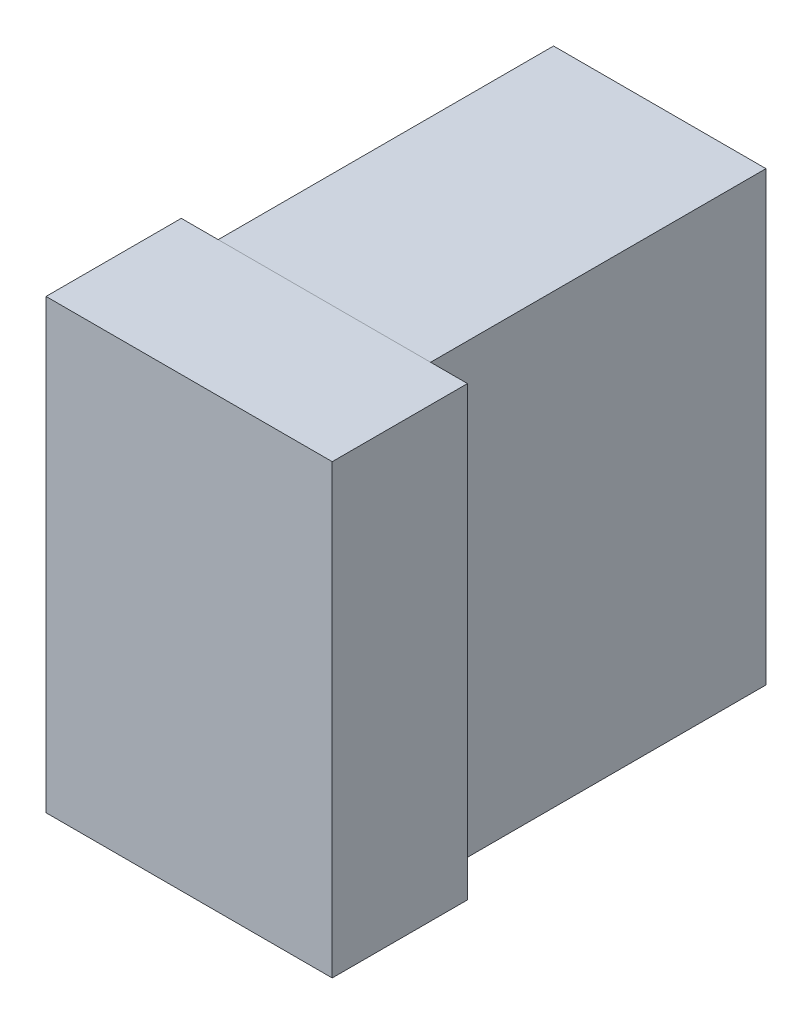
ISO-10303-21;
HEADER;
FILE_DESCRIPTION(('STEP AP214'),'2;1');
FILE_NAME('part.step','',(''),(''),'','','');
FILE_SCHEMA(('AUTOMOTIVE_DESIGN { 1 0 10303 214 1 1 1 1 }'));
ENDSEC;
DATA;
#1=APPLICATION_CONTEXT('core data for automotive mechanical design processes');
#2=APPLICATION_PROTOCOL_DEFINITION('international standard','automotive_design',2000,#1);
#3=PRODUCT_CONTEXT('',#1,'mechanical');
#4=PRODUCT('Part','Part','',(#3));
#5=PRODUCT_RELATED_PRODUCT_CATEGORY('part','',(#4));
#6=PRODUCT_DEFINITION_FORMATION('','',#4);
#7=PRODUCT_DEFINITION_CONTEXT('part definition',#1,'design');
#8=PRODUCT_DEFINITION('design','',#6,#7);
#9=PRODUCT_DEFINITION_SHAPE('','',#8);
#10=(LENGTH_UNIT() NAMED_UNIT(*) SI_UNIT(.MILLI.,.METRE.));
#11=(NAMED_UNIT(*) PLANE_ANGLE_UNIT() SI_UNIT($,.RADIAN.));
#12=(NAMED_UNIT(*) SI_UNIT($,.STERADIAN.) SOLID_ANGLE_UNIT());
#13=UNCERTAINTY_MEASURE_WITH_UNIT(LENGTH_MEASURE(1.E-05),#10,'distance_accuracy_value','');
#14=(GEOMETRIC_REPRESENTATION_CONTEXT(3) GLOBAL_UNCERTAINTY_ASSIGNED_CONTEXT((#13)) GLOBAL_UNIT_ASSIGNED_CONTEXT((#10,
#11,#12)) REPRESENTATION_CONTEXT('',''));
#15=CARTESIAN_POINT('',(0.,0.,0.));
#16=DIRECTION('',(0.,0.,1.));
#17=DIRECTION('',(1.,0.,0.));
#18=AXIS2_PLACEMENT_3D('',#15,#16,#17);
#19=CARTESIAN_POINT('',(0.,20.,0.));
#20=DIRECTION('',(0.,1.,0.));
#21=DIRECTION('',(0.,0.,1.));
#22=AXIS2_PLACEMENT_3D('',#19,#20,#21);
#23=PLANE('',#22);
#24=DIRECTION('',(0.,0.,1.));
#25=VECTOR('',#24,1.);
#26=CARTESIAN_POINT('',(4.75,20.,-21.05));
#27=LINE('',#26,#25);
#28=CARTESIAN_POINT('',(4.75,20.,-21.05));
#29=VERTEX_POINT('',#28);
#30=CARTESIAN_POINT('',(4.75,20.,-6.05));
#31=VERTEX_POINT('',#30);
#32=EDGE_CURVE('E56',#29,#31,#27,.T.);
#33=ORIENTED_EDGE('',*,*,#32,.F.);
#34=DIRECTION('',(1.,0.,0.));
#35=VECTOR('',#34,1.);
#36=CARTESIAN_POINT('',(-4.75,20.,-21.05));
#37=LINE('',#36,#35);
#38=CARTESIAN_POINT('',(-4.75,20.,-21.05));
#39=VERTEX_POINT('',#38);
#40=EDGE_CURVE('E79',#39,#29,#37,.T.);
#41=ORIENTED_EDGE('',*,*,#40,.F.);
#42=DIRECTION('',(0.,0.,-1.));
#43=VECTOR('',#42,1.);
#44=CARTESIAN_POINT('',(-4.75,20.,-6.05));
#45=LINE('',#44,#43);
#46=CARTESIAN_POINT('',(-4.75,20.,-6.05));
#47=VERTEX_POINT('',#46);
#48=EDGE_CURVE('E84',#47,#39,#45,.T.);
#49=ORIENTED_EDGE('',*,*,#48,.F.);
#50=DIRECTION('',(-1.,0.,0.));
#51=VECTOR('',#50,1.);
#52=CARTESIAN_POINT('',(4.75,20.,-6.05));
#53=LINE('',#52,#51);
#54=EDGE_CURVE('E99',#31,#47,#53,.T.);
#55=ORIENTED_EDGE('',*,*,#54,.F.);
#56=EDGE_LOOP('',(#33,#41,#49,#55));
#57=FACE_BOUND('',#56,.T.);
#58=ADVANCED_FACE('F48',(#57),#23,.T.);
#59=CARTESIAN_POINT('',(0.,0.,0.));
#60=DIRECTION('',(0.,-1.,0.));
#61=DIRECTION('',(0.,0.,-1.));
#62=AXIS2_PLACEMENT_3D('',#59,#60,#61);
#63=PLANE('',#62);
#64=DIRECTION('',(0.,0.,1.));
#65=VECTOR('',#64,1.);
#66=CARTESIAN_POINT('',(4.75,0.,-21.05));
#67=LINE('',#66,#65);
#68=CARTESIAN_POINT('',(4.75,0.,-21.05));
#69=VERTEX_POINT('',#68);
#70=CARTESIAN_POINT('',(4.75,0.,-6.05));
#71=VERTEX_POINT('',#70);
#72=EDGE_CURVE('E108',#69,#71,#67,.T.);
#73=ORIENTED_EDGE('',*,*,#72,.T.);
#74=DIRECTION('',(-1.,0.,0.));
#75=VECTOR('',#74,1.);
#76=CARTESIAN_POINT('',(4.75,0.,-6.05));
#77=LINE('',#76,#75);
#78=CARTESIAN_POINT('',(-4.75,0.,-6.05));
#79=VERTEX_POINT('',#78);
#80=EDGE_CURVE('E97',#71,#79,#77,.T.);
#81=ORIENTED_EDGE('',*,*,#80,.T.);
#82=DIRECTION('',(0.,0.,-1.));
#83=VECTOR('',#82,1.);
#84=CARTESIAN_POINT('',(-4.75,0.,-6.05));
#85=LINE('',#84,#83);
#86=CARTESIAN_POINT('',(-4.75,0.,-21.05));
#87=VERTEX_POINT('',#86);
#88=EDGE_CURVE('E100',#79,#87,#85,.T.);
#89=ORIENTED_EDGE('',*,*,#88,.T.);
#90=DIRECTION('',(1.,0.,0.));
#91=VECTOR('',#90,1.);
#92=CARTESIAN_POINT('',(-4.75,0.,-21.05));
#93=LINE('',#92,#91);
#94=EDGE_CURVE('E105',#87,#69,#93,.T.);
#95=ORIENTED_EDGE('',*,*,#94,.T.);
#96=EDGE_LOOP('',(#73,#81,#89,#95));
#97=FACE_BOUND('',#96,.T.);
#98=ADVANCED_FACE('F107',(#97),#63,.T.);
#99=CARTESIAN_POINT('',(4.75,37.7552809045647,-6.05));
#100=DIRECTION('',(0.,0.,1.));
#101=DIRECTION('',(1.,0.,0.));
#102=AXIS2_PLACEMENT_3D('',#99,#100,#101);
#103=PLANE('',#102);
#104=DIRECTION('',(0.,-1.,0.));
#105=VECTOR('',#104,1.);
#106=CARTESIAN_POINT('',(4.75,37.7552809045647,-6.05));
#107=LINE('',#106,#105);
#108=EDGE_CURVE('E12',#31,#71,#107,.T.);
#109=ORIENTED_EDGE('',*,*,#108,.F.);
#110=ORIENTED_EDGE('',*,*,#54,.T.);
#111=DIRECTION('',(0.,-1.,0.));
#112=VECTOR('',#111,1.);
#113=CARTESIAN_POINT('',(-4.75,37.7552809045647,-6.05));
#114=LINE('',#113,#112);
#115=EDGE_CURVE('E94',#47,#79,#114,.T.);
#116=ORIENTED_EDGE('',*,*,#115,.T.);
#117=ORIENTED_EDGE('',*,*,#80,.F.);
#118=EDGE_LOOP('',(#109,#110,#116,#117));
#119=FACE_BOUND('',#118,.T.);
#120=ADVANCED_FACE('F95',(#119),#103,.T.);
#121=CARTESIAN_POINT('',(-4.75,37.7552809045647,-6.05));
#122=DIRECTION('',(-1.,0.,0.));
#123=DIRECTION('',(0.,0.,1.));
#124=AXIS2_PLACEMENT_3D('',#121,#122,#123);
#125=PLANE('',#124);
#126=ORIENTED_EDGE('',*,*,#115,.F.);
#127=ORIENTED_EDGE('',*,*,#48,.T.);
#128=DIRECTION('',(0.,-1.,0.));
#129=VECTOR('',#128,1.);
#130=CARTESIAN_POINT('',(-4.75,37.7552809045647,-21.05));
#131=LINE('',#130,#129);
#132=EDGE_CURVE('E89',#39,#87,#131,.T.);
#133=ORIENTED_EDGE('',*,*,#132,.T.);
#134=ORIENTED_EDGE('',*,*,#88,.F.);
#135=EDGE_LOOP('',(#126,#127,#133,#134));
#136=FACE_BOUND('',#135,.T.);
#137=ADVANCED_FACE('F101',(#136),#125,.T.);
#138=CARTESIAN_POINT('',(-4.75,37.7552809045647,-21.05));
#139=DIRECTION('',(0.,0.,-1.));
#140=DIRECTION('',(-1.,0.,0.));
#141=AXIS2_PLACEMENT_3D('',#138,#139,#140);
#142=PLANE('',#141);
#143=ORIENTED_EDGE('',*,*,#132,.F.);
#144=ORIENTED_EDGE('',*,*,#40,.T.);
#145=DIRECTION('',(0.,-1.,0.));
#146=VECTOR('',#145,1.);
#147=CARTESIAN_POINT('',(4.75,37.7552809045647,-21.05));
#148=LINE('',#147,#146);
#149=EDGE_CURVE('E115',#29,#69,#148,.T.);
#150=ORIENTED_EDGE('',*,*,#149,.T.);
#151=ORIENTED_EDGE('',*,*,#94,.F.);
#152=EDGE_LOOP('',(#143,#144,#150,#151));
#153=FACE_BOUND('',#152,.T.);
#154=ADVANCED_FACE('F121',(#153),#142,.T.);
#155=CARTESIAN_POINT('',(4.75,37.7552809045647,-21.05));
#156=DIRECTION('',(1.,0.,0.));
#157=DIRECTION('',(0.,0.,-1.));
#158=AXIS2_PLACEMENT_3D('',#155,#156,#157);
#159=PLANE('',#158);
#160=ORIENTED_EDGE('',*,*,#149,.F.);
#161=ORIENTED_EDGE('',*,*,#32,.T.);
#162=ORIENTED_EDGE('',*,*,#108,.T.);
#163=ORIENTED_EDGE('',*,*,#72,.F.);
#164=EDGE_LOOP('',(#160,#161,#162,#163));
#165=FACE_BOUND('',#164,.T.);
#166=ADVANCED_FACE('F122',(#165),#159,.T.);
#167=CLOSED_SHELL('',(#58,#98,#120,#137,#154,#166));
#168=MANIFOLD_SOLID_BREP('B2',#167);
#169=CARTESIAN_POINT('',(-6.4,20.,0.));
#170=DIRECTION('',(0.,0.,-1.));
#171=DIRECTION('',(-1.,0.,0.));
#172=AXIS2_PLACEMENT_3D('',#169,#170,#171);
#173=PLANE('',#172);
#174=DIRECTION('',(1.,0.,0.));
#175=VECTOR('',#174,1.);
#176=CARTESIAN_POINT('',(-6.4,0.,0.));
#177=LINE('',#176,#175);
#178=CARTESIAN_POINT('',(-6.4,0.,0.));
#179=VERTEX_POINT('',#178);
#180=CARTESIAN_POINT('',(6.4,0.,0.));
#181=VERTEX_POINT('',#180);
#182=EDGE_CURVE('E234',#179,#181,#177,.T.);
#183=ORIENTED_EDGE('',*,*,#182,.T.);
#184=DIRECTION('',(0.,-1.,0.));
#185=VECTOR('',#184,1.);
#186=CARTESIAN_POINT('',(6.4,20.,0.));
#187=LINE('',#186,#185);
#188=CARTESIAN_POINT('',(6.4,20.,0.));
#189=VERTEX_POINT('',#188);
#190=EDGE_CURVE('E46',#189,#181,#187,.T.);
#191=ORIENTED_EDGE('',*,*,#190,.F.);
#192=DIRECTION('',(1.,0.,0.));
#193=VECTOR('',#192,1.);
#194=CARTESIAN_POINT('',(-6.4,20.,0.));
#195=LINE('',#194,#193);
#196=CARTESIAN_POINT('',(-6.4,20.,0.));
#197=VERTEX_POINT('',#196);
#198=EDGE_CURVE('E222',#197,#189,#195,.T.);
#199=ORIENTED_EDGE('',*,*,#198,.F.);
#200=DIRECTION('',(0.,-1.,0.));
#201=VECTOR('',#200,1.);
#202=CARTESIAN_POINT('',(-6.4,20.,0.));
#203=LINE('',#202,#201);
#204=EDGE_CURVE('E230',#197,#179,#203,.T.);
#205=ORIENTED_EDGE('',*,*,#204,.T.);
#206=EDGE_LOOP('',(#183,#191,#199,#205));
#207=FACE_BOUND('',#206,.T.);
#208=ADVANCED_FACE('F171',(#207),#173,.F.);
#209=CARTESIAN_POINT('',(6.4,20.,0.));
#210=DIRECTION('',(-1.,0.,0.));
#211=DIRECTION('',(0.,0.,1.));
#212=AXIS2_PLACEMENT_3D('',#209,#210,#211);
#213=PLANE('',#212);
#214=DIRECTION('',(0.,0.,-1.));
#215=VECTOR('',#214,1.);
#216=CARTESIAN_POINT('',(6.4,0.,0.));
#217=LINE('',#216,#215);
#218=CARTESIAN_POINT('',(6.4,0.,-6.05));
#219=VERTEX_POINT('',#218);
#220=EDGE_CURVE('E226',#181,#219,#217,.T.);
#221=ORIENTED_EDGE('',*,*,#220,.T.);
#222=DIRECTION('',(0.,-1.,0.));
#223=VECTOR('',#222,1.);
#224=CARTESIAN_POINT('',(6.4,20.,-6.05));
#225=LINE('',#224,#223);
#226=CARTESIAN_POINT('',(6.4,20.,-6.05));
#227=VERTEX_POINT('',#226);
#228=EDGE_CURVE('E179',#227,#219,#225,.T.);
#229=ORIENTED_EDGE('',*,*,#228,.F.);
#230=DIRECTION('',(0.,0.,-1.));
#231=VECTOR('',#230,1.);
#232=CARTESIAN_POINT('',(6.4,20.,0.));
#233=LINE('',#232,#231);
#234=EDGE_CURVE('E217',#189,#227,#233,.T.);
#235=ORIENTED_EDGE('',*,*,#234,.F.);
#236=ORIENTED_EDGE('',*,*,#190,.T.);
#237=EDGE_LOOP('',(#221,#229,#235,#236));
#238=FACE_BOUND('',#237,.T.);
#239=ADVANCED_FACE('F225',(#238),#213,.F.);
#240=CARTESIAN_POINT('',(6.4,20.,-6.05));
#241=DIRECTION('',(0.,0.,1.));
#242=DIRECTION('',(1.,0.,0.));
#243=AXIS2_PLACEMENT_3D('',#240,#241,#242);
#244=PLANE('',#243);
#245=DIRECTION('',(-1.,0.,0.));
#246=VECTOR('',#245,1.);
#247=CARTESIAN_POINT('',(6.4,0.,-6.05));
#248=LINE('',#247,#246);
#249=CARTESIAN_POINT('',(-6.4,0.,-6.05));
#250=VERTEX_POINT('',#249);
#251=EDGE_CURVE('E204',#219,#250,#248,.T.);
#252=ORIENTED_EDGE('',*,*,#251,.T.);
#253=DIRECTION('',(0.,-1.,0.));
#254=VECTOR('',#253,1.);
#255=CARTESIAN_POINT('',(-6.4,20.,-6.05));
#256=LINE('',#255,#254);
#257=CARTESIAN_POINT('',(-6.4,20.,-6.05));
#258=VERTEX_POINT('',#257);
#259=EDGE_CURVE('E227',#258,#250,#256,.T.);
#260=ORIENTED_EDGE('',*,*,#259,.F.);
#261=DIRECTION('',(-1.,0.,0.));
#262=VECTOR('',#261,1.);
#263=CARTESIAN_POINT('',(6.4,20.,-6.05));
#264=LINE('',#263,#262);
#265=EDGE_CURVE('E220',#227,#258,#264,.T.);
#266=ORIENTED_EDGE('',*,*,#265,.F.);
#267=ORIENTED_EDGE('',*,*,#228,.T.);
#268=EDGE_LOOP('',(#252,#260,#266,#267));
#269=FACE_BOUND('',#268,.T.);
#270=ADVANCED_FACE('F228',(#269),#244,.F.);
#271=CARTESIAN_POINT('',(-6.4,20.,-6.05));
#272=DIRECTION('',(1.,0.,0.));
#273=DIRECTION('',(0.,0.,-1.));
#274=AXIS2_PLACEMENT_3D('',#271,#272,#273);
#275=PLANE('',#274);
#276=DIRECTION('',(0.,0.,1.));
#277=VECTOR('',#276,1.);
#278=CARTESIAN_POINT('',(-6.4,0.,-6.05));
#279=LINE('',#278,#277);
#280=EDGE_CURVE('E210',#250,#179,#279,.T.);
#281=ORIENTED_EDGE('',*,*,#280,.T.);
#282=ORIENTED_EDGE('',*,*,#204,.F.);
#283=DIRECTION('',(0.,0.,1.));
#284=VECTOR('',#283,1.);
#285=CARTESIAN_POINT('',(-6.4,20.,-6.05));
#286=LINE('',#285,#284);
#287=EDGE_CURVE('E187',#258,#197,#286,.T.);
#288=ORIENTED_EDGE('',*,*,#287,.F.);
#289=ORIENTED_EDGE('',*,*,#259,.T.);
#290=EDGE_LOOP('',(#281,#282,#288,#289));
#291=FACE_BOUND('',#290,.T.);
#292=ADVANCED_FACE('F241',(#291),#275,.F.);
#293=CARTESIAN_POINT('',(0.,20.,0.));
#294=DIRECTION('',(0.,1.,0.));
#295=DIRECTION('',(0.,0.,1.));
#296=AXIS2_PLACEMENT_3D('',#293,#294,#295);
#297=PLANE('',#296);
#298=ORIENTED_EDGE('',*,*,#198,.T.);
#299=ORIENTED_EDGE('',*,*,#234,.T.);
#300=ORIENTED_EDGE('',*,*,#265,.T.);
#301=ORIENTED_EDGE('',*,*,#287,.T.);
#302=EDGE_LOOP('',(#298,#299,#300,#301));
#303=FACE_BOUND('',#302,.T.);
#304=ADVANCED_FACE('F218',(#303),#297,.T.);
#305=CARTESIAN_POINT('',(0.,0.,0.));
#306=DIRECTION('',(0.,1.,0.));
#307=DIRECTION('',(0.,0.,1.));
#308=AXIS2_PLACEMENT_3D('',#305,#306,#307);
#309=PLANE('',#308);
#310=ORIENTED_EDGE('',*,*,#182,.F.);
#311=ORIENTED_EDGE('',*,*,#280,.F.);
#312=ORIENTED_EDGE('',*,*,#251,.F.);
#313=ORIENTED_EDGE('',*,*,#220,.F.);
#314=EDGE_LOOP('',(#310,#311,#312,#313));
#315=FACE_BOUND('',#314,.T.);
#316=ADVANCED_FACE('F244',(#315),#309,.F.);
#317=CLOSED_SHELL('',(#208,#239,#270,#292,#304,#316));
#318=MANIFOLD_SOLID_BREP('B6',#317);
#319=ADVANCED_BREP_SHAPE_REPRESENTATION('',(#18,#168,#318),#14);
#320=SHAPE_DEFINITION_REPRESENTATION(#9,#319);
ENDSEC;
END-ISO-10303-21;
